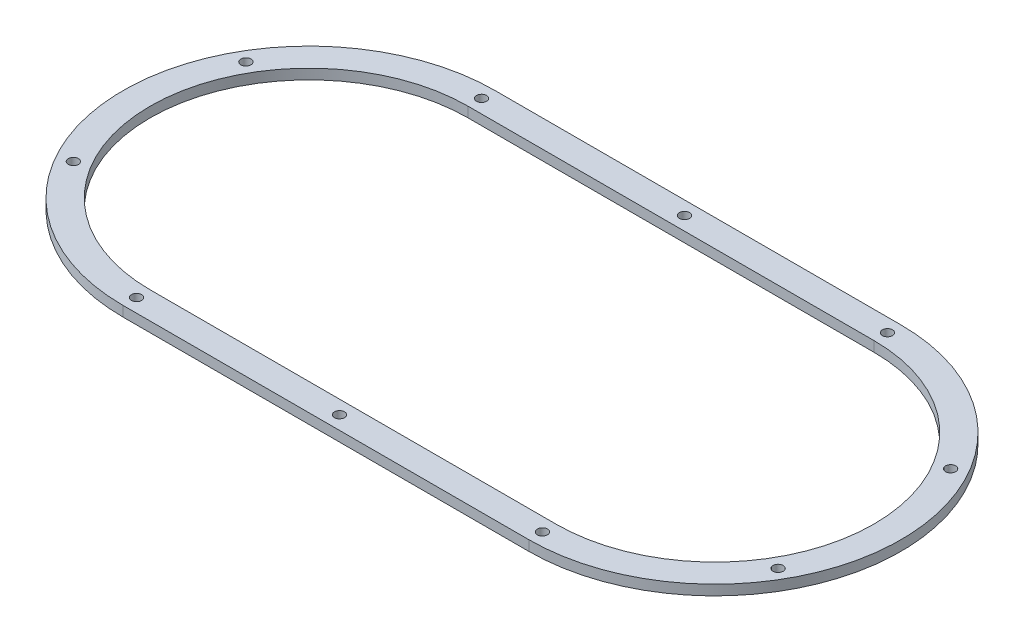
ISO-10303-21;
HEADER;
FILE_DESCRIPTION(('STEP AP214'),'2;1');
FILE_NAME('part.step','',(''),(''),'','','');
FILE_SCHEMA(('AUTOMOTIVE_DESIGN { 1 0 10303 214 1 1 1 1 }'));
ENDSEC;
DATA;
#1=APPLICATION_CONTEXT('core data for automotive mechanical design processes');
#2=APPLICATION_PROTOCOL_DEFINITION('international standard','automotive_design',2000,#1);
#3=PRODUCT_CONTEXT('',#1,'mechanical');
#4=PRODUCT('Part','Part','',(#3));
#5=PRODUCT_RELATED_PRODUCT_CATEGORY('part','',(#4));
#6=PRODUCT_DEFINITION_FORMATION('','',#4);
#7=PRODUCT_DEFINITION_CONTEXT('part definition',#1,'design');
#8=PRODUCT_DEFINITION('design','',#6,#7);
#9=PRODUCT_DEFINITION_SHAPE('','',#8);
#10=(LENGTH_UNIT() NAMED_UNIT(*) SI_UNIT(.MILLI.,.METRE.));
#11=(NAMED_UNIT(*) PLANE_ANGLE_UNIT() SI_UNIT($,.RADIAN.));
#12=(NAMED_UNIT(*) SI_UNIT($,.STERADIAN.) SOLID_ANGLE_UNIT());
#13=UNCERTAINTY_MEASURE_WITH_UNIT(LENGTH_MEASURE(1.E-05),#10,'distance_accuracy_value','');
#14=(GEOMETRIC_REPRESENTATION_CONTEXT(3) GLOBAL_UNCERTAINTY_ASSIGNED_CONTEXT((#13)) GLOBAL_UNIT_ASSIGNED_CONTEXT((#10,
#11,#12)) REPRESENTATION_CONTEXT('',''));
#15=CARTESIAN_POINT('',(0.,0.,0.));
#16=DIRECTION('',(0.,0.,1.));
#17=DIRECTION('',(1.,0.,0.));
#18=AXIS2_PLACEMENT_3D('',#15,#16,#17);
#19=CARTESIAN_POINT('',(0.,0.,0.));
#20=DIRECTION('',(0.,1.,0.));
#21=DIRECTION('',(0.,0.,1.));
#22=AXIS2_PLACEMENT_3D('',#19,#20,#21);
#23=PLANE('',#22);
#24=DIRECTION('',(1.,0.,0.));
#25=VECTOR('',#24,1.);
#26=CARTESIAN_POINT('',(0.,0.,47.));
#27=LINE('',#26,#25);
#28=CARTESIAN_POINT('',(-60.,0.,47.));
#29=VERTEX_POINT('',#28);
#30=CARTESIAN_POINT('',(60.,0.,47.));
#31=VERTEX_POINT('',#30);
#32=EDGE_CURVE('E145',#29,#31,#27,.T.);
#33=ORIENTED_EDGE('',*,*,#32,.T.);
#34=CARTESIAN_POINT('',(60.,0.,0.));
#35=DIRECTION('',(0.,1.,0.));
#36=DIRECTION('',(0.,0.,1.));
#37=AXIS2_PLACEMENT_3D('',#34,#35,#36);
#38=CIRCLE('',#37,47.);
#39=CARTESIAN_POINT('',(60.,0.,-47.));
#40=VERTEX_POINT('',#39);
#41=EDGE_CURVE('E149',#31,#40,#38,.T.);
#42=ORIENTED_EDGE('',*,*,#41,.T.);
#43=DIRECTION('',(-1.,0.,0.));
#44=VECTOR('',#43,1.);
#45=CARTESIAN_POINT('',(0.,0.,-47.));
#46=LINE('',#45,#44);
#47=CARTESIAN_POINT('',(-60.,0.,-47.));
#48=VERTEX_POINT('',#47);
#49=EDGE_CURVE('E136',#40,#48,#46,.T.);
#50=ORIENTED_EDGE('',*,*,#49,.T.);
#51=CARTESIAN_POINT('',(-60.,0.,0.));
#52=DIRECTION('',(0.,1.,0.));
#53=DIRECTION('',(0.,0.,1.));
#54=AXIS2_PLACEMENT_3D('',#51,#52,#53);
#55=CIRCLE('',#54,47.);
#56=EDGE_CURVE('E111',#48,#29,#55,.T.);
#57=ORIENTED_EDGE('',*,*,#56,.T.);
#58=EDGE_LOOP('',(#33,#42,#50,#57));
#59=FACE_BOUND('',#58,.T.);
#60=CARTESIAN_POINT('',(-60.,0.,51.));
#61=DIRECTION('',(0.,1.,0.));
#62=DIRECTION('',(0.,0.,1.));
#63=AXIS2_PLACEMENT_3D('',#60,#61,#62);
#64=CIRCLE('',#63,1.49999999999481);
#65=CARTESIAN_POINT('',(-60.,0.,52.4999999999948));
#66=VERTEX_POINT('',#65);
#67=EDGE_CURVE('E213',#66,#66,#64,.T.);
#68=ORIENTED_EDGE('',*,*,#67,.T.);
#69=EDGE_LOOP('',(#68));
#70=FACE_BOUND('',#69,.T.);
#71=CARTESIAN_POINT('',(-104.167295593006,0.,25.5));
#72=DIRECTION('',(0.,1.,0.));
#73=DIRECTION('',(0.,0.,1.));
#74=AXIS2_PLACEMENT_3D('',#71,#72,#73);
#75=CIRCLE('',#74,1.49999999999561);
#76=CARTESIAN_POINT('',(-104.167295593006,0.,26.9999999999956));
#77=VERTEX_POINT('',#76);
#78=EDGE_CURVE('E209',#77,#77,#75,.T.);
#79=ORIENTED_EDGE('',*,*,#78,.T.);
#80=EDGE_LOOP('',(#79));
#81=FACE_BOUND('',#80,.T.);
#82=CARTESIAN_POINT('',(-104.167295593006,0.,-25.4999999999999));
#83=DIRECTION('',(0.,1.,0.));
#84=DIRECTION('',(0.,0.,1.));
#85=AXIS2_PLACEMENT_3D('',#82,#83,#84);
#86=CIRCLE('',#85,1.4999999999985);
#87=CARTESIAN_POINT('',(-104.167295593006,0.,-24.0000000000014));
#88=VERTEX_POINT('',#87);
#89=EDGE_CURVE('E205',#88,#88,#86,.T.);
#90=ORIENTED_EDGE('',*,*,#89,.T.);
#91=EDGE_LOOP('',(#90));
#92=FACE_BOUND('',#91,.T.);
#93=CARTESIAN_POINT('',(-60.,0.,-51.));
#94=DIRECTION('',(0.,1.,0.));
#95=DIRECTION('',(0.,0.,1.));
#96=AXIS2_PLACEMENT_3D('',#93,#94,#95);
#97=CIRCLE('',#96,1.5);
#98=CARTESIAN_POINT('',(-60.,0.,-49.5));
#99=VERTEX_POINT('',#98);
#100=EDGE_CURVE('E201',#99,#99,#97,.T.);
#101=ORIENTED_EDGE('',*,*,#100,.T.);
#102=EDGE_LOOP('',(#101));
#103=FACE_BOUND('',#102,.T.);
#104=CARTESIAN_POINT('',(0.,0.,-51.));
#105=DIRECTION('',(0.,1.,0.));
#106=DIRECTION('',(0.,0.,1.));
#107=AXIS2_PLACEMENT_3D('',#104,#105,#106);
#108=CIRCLE('',#107,1.5);
#109=CARTESIAN_POINT('',(0.,0.,-49.5));
#110=VERTEX_POINT('',#109);
#111=EDGE_CURVE('E197',#110,#110,#108,.T.);
#112=ORIENTED_EDGE('',*,*,#111,.T.);
#113=EDGE_LOOP('',(#112));
#114=FACE_BOUND('',#113,.T.);
#115=CARTESIAN_POINT('',(60.,0.,-51.));
#116=DIRECTION('',(0.,1.,0.));
#117=DIRECTION('',(0.,0.,1.));
#118=AXIS2_PLACEMENT_3D('',#115,#116,#117);
#119=CIRCLE('',#118,1.5);
#120=CARTESIAN_POINT('',(60.,0.,-49.5));
#121=VERTEX_POINT('',#120);
#122=EDGE_CURVE('E193',#121,#121,#119,.T.);
#123=ORIENTED_EDGE('',*,*,#122,.T.);
#124=EDGE_LOOP('',(#123));
#125=FACE_BOUND('',#124,.T.);
#126=CARTESIAN_POINT('',(-60.,0.,0.));
#127=DIRECTION('',(0.,1.,0.));
#128=DIRECTION('',(0.,0.,1.));
#129=AXIS2_PLACEMENT_3D('',#126,#127,#128);
#130=CIRCLE('',#129,55.);
#131=CARTESIAN_POINT('',(-60.,0.,-55.));
#132=VERTEX_POINT('',#131);
#133=CARTESIAN_POINT('',(-60.,0.,55.));
#134=VERTEX_POINT('',#133);
#135=EDGE_CURVE('E11',#132,#134,#130,.T.);
#136=ORIENTED_EDGE('',*,*,#135,.F.);
#137=DIRECTION('',(-1.,0.,0.));
#138=VECTOR('',#137,1.);
#139=CARTESIAN_POINT('',(0.,0.,-55.));
#140=LINE('',#139,#138);
#141=CARTESIAN_POINT('',(60.,0.,-55.));
#142=VERTEX_POINT('',#141);
#143=EDGE_CURVE('E48',#142,#132,#140,.T.);
#144=ORIENTED_EDGE('',*,*,#143,.F.);
#145=CARTESIAN_POINT('',(60.,0.,0.));
#146=DIRECTION('',(0.,1.,0.));
#147=DIRECTION('',(0.,0.,1.));
#148=AXIS2_PLACEMENT_3D('',#145,#146,#147);
#149=CIRCLE('',#148,55.);
#150=CARTESIAN_POINT('',(60.,0.,55.));
#151=VERTEX_POINT('',#150);
#152=EDGE_CURVE('E265',#151,#142,#149,.T.);
#153=ORIENTED_EDGE('',*,*,#152,.F.);
#154=DIRECTION('',(1.,0.,0.));
#155=VECTOR('',#154,1.);
#156=CARTESIAN_POINT('',(0.,0.,55.));
#157=LINE('',#156,#155);
#158=EDGE_CURVE('E253',#134,#151,#157,.T.);
#159=ORIENTED_EDGE('',*,*,#158,.F.);
#160=EDGE_LOOP('',(#136,#144,#153,#159));
#161=FACE_BOUND('',#160,.T.);
#162=CARTESIAN_POINT('',(0.,0.,51.));
#163=DIRECTION('',(0.,1.,0.));
#164=DIRECTION('',(0.,0.,1.));
#165=AXIS2_PLACEMENT_3D('',#162,#163,#164);
#166=CIRCLE('',#165,1.5);
#167=CARTESIAN_POINT('',(0.,0.,52.5));
#168=VERTEX_POINT('',#167);
#169=EDGE_CURVE('E217',#168,#168,#166,.F.);
#170=ORIENTED_EDGE('',*,*,#169,.F.);
#171=EDGE_LOOP('',(#170));
#172=FACE_BOUND('',#171,.T.);
#173=CARTESIAN_POINT('',(60.,0.,51.));
#174=DIRECTION('',(0.,1.,0.));
#175=DIRECTION('',(0.,0.,1.));
#176=AXIS2_PLACEMENT_3D('',#173,#174,#175);
#177=CIRCLE('',#176,1.5);
#178=CARTESIAN_POINT('',(60.,0.,52.5));
#179=VERTEX_POINT('',#178);
#180=EDGE_CURVE('E221',#179,#179,#177,.F.);
#181=ORIENTED_EDGE('',*,*,#180,.F.);
#182=EDGE_LOOP('',(#181));
#183=FACE_BOUND('',#182,.T.);
#184=CARTESIAN_POINT('',(104.167295593006,0.,25.5));
#185=DIRECTION('',(0.,1.,0.));
#186=DIRECTION('',(0.,0.,1.));
#187=AXIS2_PLACEMENT_3D('',#184,#185,#186);
#188=CIRCLE('',#187,1.49999999999561);
#189=CARTESIAN_POINT('',(104.167295593006,0.,26.9999999999956));
#190=VERTEX_POINT('',#189);
#191=EDGE_CURVE('E225',#190,#190,#188,.F.);
#192=ORIENTED_EDGE('',*,*,#191,.F.);
#193=EDGE_LOOP('',(#192));
#194=FACE_BOUND('',#193,.T.);
#195=CARTESIAN_POINT('',(104.167295593006,0.,-25.4999999999999));
#196=DIRECTION('',(0.,1.,0.));
#197=DIRECTION('',(0.,0.,1.));
#198=AXIS2_PLACEMENT_3D('',#195,#196,#197);
#199=CIRCLE('',#198,1.4999999999985);
#200=CARTESIAN_POINT('',(104.167295593006,0.,-24.0000000000014));
#201=VERTEX_POINT('',#200);
#202=EDGE_CURVE('E229',#201,#201,#199,.F.);
#203=ORIENTED_EDGE('',*,*,#202,.F.);
#204=EDGE_LOOP('',(#203));
#205=FACE_BOUND('',#204,.T.);
#206=ADVANCED_FACE('F40',(#59,#70,#81,#92,#103,#114,#125,#161,#172,#183,#194,#205),#23,.F.);
#207=CARTESIAN_POINT('',(0.,3.,0.));
#208=DIRECTION('',(0.,1.,0.));
#209=DIRECTION('',(0.,0.,1.));
#210=AXIS2_PLACEMENT_3D('',#207,#208,#209);
#211=PLANE('',#210);
#212=CARTESIAN_POINT('',(60.,3.,0.));
#213=DIRECTION('',(0.,1.,0.));
#214=DIRECTION('',(0.,0.,1.));
#215=AXIS2_PLACEMENT_3D('',#212,#213,#214);
#216=CIRCLE('',#215,47.);
#217=CARTESIAN_POINT('',(60.,3.,47.));
#218=VERTEX_POINT('',#217);
#219=CARTESIAN_POINT('',(60.,3.,-47.));
#220=VERTEX_POINT('',#219);
#221=EDGE_CURVE('E63',#218,#220,#216,.T.);
#222=ORIENTED_EDGE('',*,*,#221,.F.);
#223=DIRECTION('',(1.,0.,0.));
#224=VECTOR('',#223,1.);
#225=CARTESIAN_POINT('',(-60.,3.,47.));
#226=LINE('',#225,#224);
#227=CARTESIAN_POINT('',(-60.,3.,47.));
#228=VERTEX_POINT('',#227);
#229=EDGE_CURVE('E126',#228,#218,#226,.T.);
#230=ORIENTED_EDGE('',*,*,#229,.F.);
#231=CARTESIAN_POINT('',(-60.,3.,0.));
#232=DIRECTION('',(0.,1.,0.));
#233=DIRECTION('',(0.,0.,1.));
#234=AXIS2_PLACEMENT_3D('',#231,#232,#233);
#235=CIRCLE('',#234,47.);
#236=CARTESIAN_POINT('',(-60.,3.,-47.));
#237=VERTEX_POINT('',#236);
#238=EDGE_CURVE('E108',#237,#228,#235,.T.);
#239=ORIENTED_EDGE('',*,*,#238,.F.);
#240=DIRECTION('',(-1.,0.,0.));
#241=VECTOR('',#240,1.);
#242=CARTESIAN_POINT('',(60.,3.,-47.));
#243=LINE('',#242,#241);
#244=EDGE_CURVE('E118',#220,#237,#243,.T.);
#245=ORIENTED_EDGE('',*,*,#244,.F.);
#246=EDGE_LOOP('',(#222,#230,#239,#245));
#247=FACE_BOUND('',#246,.T.);
#248=CARTESIAN_POINT('',(104.167295593006,3.,25.5));
#249=DIRECTION('',(0.,1.,0.));
#250=DIRECTION('',(0.,0.,1.));
#251=AXIS2_PLACEMENT_3D('',#248,#249,#250);
#252=CIRCLE('',#251,1.49999999999561);
#253=CARTESIAN_POINT('',(104.167295593006,3.,26.9999999999956));
#254=VERTEX_POINT('',#253);
#255=EDGE_CURVE('E163',#254,#254,#252,.F.);
#256=ORIENTED_EDGE('',*,*,#255,.T.);
#257=EDGE_LOOP('',(#256));
#258=FACE_BOUND('',#257,.T.);
#259=CARTESIAN_POINT('',(0.,3.,51.));
#260=DIRECTION('',(0.,1.,0.));
#261=DIRECTION('',(0.,0.,1.));
#262=AXIS2_PLACEMENT_3D('',#259,#260,#261);
#263=CIRCLE('',#262,1.5);
#264=CARTESIAN_POINT('',(0.,3.,52.5));
#265=VERTEX_POINT('',#264);
#266=EDGE_CURVE('E171',#265,#265,#263,.F.);
#267=ORIENTED_EDGE('',*,*,#266,.T.);
#268=EDGE_LOOP('',(#267));
#269=FACE_BOUND('',#268,.T.);
#270=CARTESIAN_POINT('',(-60.,3.,51.));
#271=DIRECTION('',(0.,1.,0.));
#272=DIRECTION('',(0.,0.,1.));
#273=AXIS2_PLACEMENT_3D('',#270,#271,#272);
#274=CIRCLE('',#273,1.49999999999481);
#275=CARTESIAN_POINT('',(-60.,3.,52.4999999999948));
#276=VERTEX_POINT('',#275);
#277=EDGE_CURVE('E175',#276,#276,#274,.T.);
#278=ORIENTED_EDGE('',*,*,#277,.F.);
#279=EDGE_LOOP('',(#278));
#280=FACE_BOUND('',#279,.T.);
#281=CARTESIAN_POINT('',(-104.167295593006,3.,25.5));
#282=DIRECTION('',(0.,1.,0.));
#283=DIRECTION('',(0.,0.,1.));
#284=AXIS2_PLACEMENT_3D('',#281,#282,#283);
#285=CIRCLE('',#284,1.49999999999561);
#286=CARTESIAN_POINT('',(-104.167295593006,3.,26.9999999999956));
#287=VERTEX_POINT('',#286);
#288=EDGE_CURVE('E179',#287,#287,#285,.T.);
#289=ORIENTED_EDGE('',*,*,#288,.F.);
#290=EDGE_LOOP('',(#289));
#291=FACE_BOUND('',#290,.T.);
#292=CARTESIAN_POINT('',(-104.167295593006,3.,-25.4999999999999));
#293=DIRECTION('',(0.,1.,0.));
#294=DIRECTION('',(0.,0.,1.));
#295=AXIS2_PLACEMENT_3D('',#292,#293,#294);
#296=CIRCLE('',#295,1.4999999999985);
#297=CARTESIAN_POINT('',(-104.167295593006,3.,-24.0000000000014));
#298=VERTEX_POINT('',#297);
#299=EDGE_CURVE('E183',#298,#298,#296,.T.);
#300=ORIENTED_EDGE('',*,*,#299,.F.);
#301=EDGE_LOOP('',(#300));
#302=FACE_BOUND('',#301,.T.);
#303=CARTESIAN_POINT('',(-60.,3.,-51.));
#304=DIRECTION('',(0.,1.,0.));
#305=DIRECTION('',(0.,0.,1.));
#306=AXIS2_PLACEMENT_3D('',#303,#304,#305);
#307=CIRCLE('',#306,1.5);
#308=CARTESIAN_POINT('',(-60.,3.,-49.5));
#309=VERTEX_POINT('',#308);
#310=EDGE_CURVE('E157',#309,#309,#307,.T.);
#311=ORIENTED_EDGE('',*,*,#310,.F.);
#312=EDGE_LOOP('',(#311));
#313=FACE_BOUND('',#312,.T.);
#314=CARTESIAN_POINT('',(0.,3.,-51.));
#315=DIRECTION('',(0.,1.,0.));
#316=DIRECTION('',(0.,0.,1.));
#317=AXIS2_PLACEMENT_3D('',#314,#315,#316);
#318=CIRCLE('',#317,1.5);
#319=CARTESIAN_POINT('',(0.,3.,-49.5));
#320=VERTEX_POINT('',#319);
#321=EDGE_CURVE('E153',#320,#320,#318,.T.);
#322=ORIENTED_EDGE('',*,*,#321,.F.);
#323=EDGE_LOOP('',(#322));
#324=FACE_BOUND('',#323,.T.);
#325=CARTESIAN_POINT('',(60.,3.,-51.));
#326=DIRECTION('',(0.,1.,0.));
#327=DIRECTION('',(0.,0.,1.));
#328=AXIS2_PLACEMENT_3D('',#325,#326,#327);
#329=CIRCLE('',#328,1.5);
#330=CARTESIAN_POINT('',(60.,3.,-49.5));
#331=VERTEX_POINT('',#330);
#332=EDGE_CURVE('E162',#331,#331,#329,.T.);
#333=ORIENTED_EDGE('',*,*,#332,.F.);
#334=EDGE_LOOP('',(#333));
#335=FACE_BOUND('',#334,.T.);
#336=DIRECTION('',(-1.,0.,0.));
#337=VECTOR('',#336,1.);
#338=CARTESIAN_POINT('',(60.,3.,-55.));
#339=LINE('',#338,#337);
#340=CARTESIAN_POINT('',(60.,3.,-55.));
#341=VERTEX_POINT('',#340);
#342=CARTESIAN_POINT('',(-60.,3.,-55.));
#343=VERTEX_POINT('',#342);
#344=EDGE_CURVE('E245',#341,#343,#339,.T.);
#345=ORIENTED_EDGE('',*,*,#344,.T.);
#346=CARTESIAN_POINT('',(-60.,3.,0.));
#347=DIRECTION('',(0.,1.,0.));
#348=DIRECTION('',(0.,0.,1.));
#349=AXIS2_PLACEMENT_3D('',#346,#347,#348);
#350=CIRCLE('',#349,55.);
#351=CARTESIAN_POINT('',(-60.,3.,55.));
#352=VERTEX_POINT('',#351);
#353=EDGE_CURVE('E233',#343,#352,#350,.T.);
#354=ORIENTED_EDGE('',*,*,#353,.T.);
#355=DIRECTION('',(1.,0.,0.));
#356=VECTOR('',#355,1.);
#357=CARTESIAN_POINT('',(-60.,3.,55.));
#358=LINE('',#357,#356);
#359=CARTESIAN_POINT('',(60.,3.,55.));
#360=VERTEX_POINT('',#359);
#361=EDGE_CURVE('E237',#352,#360,#358,.T.);
#362=ORIENTED_EDGE('',*,*,#361,.T.);
#363=CARTESIAN_POINT('',(60.,3.,0.));
#364=DIRECTION('',(0.,1.,0.));
#365=DIRECTION('',(0.,0.,1.));
#366=AXIS2_PLACEMENT_3D('',#363,#364,#365);
#367=CIRCLE('',#366,55.);
#368=EDGE_CURVE('E241',#360,#341,#367,.T.);
#369=ORIENTED_EDGE('',*,*,#368,.T.);
#370=EDGE_LOOP('',(#345,#354,#362,#369));
#371=FACE_BOUND('',#370,.T.);
#372=CARTESIAN_POINT('',(60.,3.,51.));
#373=DIRECTION('',(0.,1.,0.));
#374=DIRECTION('',(0.,0.,1.));
#375=AXIS2_PLACEMENT_3D('',#372,#373,#374);
#376=CIRCLE('',#375,1.5);
#377=CARTESIAN_POINT('',(60.,3.,52.5));
#378=VERTEX_POINT('',#377);
#379=EDGE_CURVE('E167',#378,#378,#376,.F.);
#380=ORIENTED_EDGE('',*,*,#379,.T.);
#381=EDGE_LOOP('',(#380));
#382=FACE_BOUND('',#381,.T.);
#383=CARTESIAN_POINT('',(104.167295593006,3.,-25.4999999999999));
#384=DIRECTION('',(0.,1.,0.));
#385=DIRECTION('',(0.,0.,1.));
#386=AXIS2_PLACEMENT_3D('',#383,#384,#385);
#387=CIRCLE('',#386,1.4999999999985);
#388=CARTESIAN_POINT('',(104.167295593006,3.,-24.0000000000014));
#389=VERTEX_POINT('',#388);
#390=EDGE_CURVE('E158',#389,#389,#387,.F.);
#391=ORIENTED_EDGE('',*,*,#390,.T.);
#392=EDGE_LOOP('',(#391));
#393=FACE_BOUND('',#392,.T.);
#394=ADVANCED_FACE('F123',(#247,#258,#269,#280,#291,#302,#313,#324,#335,#371,#382,#393),#211,.T.);
#395=CARTESIAN_POINT('',(-60.,-7.,0.));
#396=DIRECTION('',(0.,1.,0.));
#397=DIRECTION('',(0.,0.,1.));
#398=AXIS2_PLACEMENT_3D('',#395,#396,#397);
#399=CYLINDRICAL_SURFACE('',#398,55.);
#400=ORIENTED_EDGE('',*,*,#135,.T.);
#401=DIRECTION('',(0.,1.,0.));
#402=VECTOR('',#401,1.);
#403=CARTESIAN_POINT('',(-60.,-7.,55.));
#404=LINE('',#403,#402);
#405=EDGE_CURVE('E249',#134,#352,#404,.T.);
#406=ORIENTED_EDGE('',*,*,#405,.T.);
#407=ORIENTED_EDGE('',*,*,#353,.F.);
#408=DIRECTION('',(0.,1.,0.));
#409=VECTOR('',#408,1.);
#410=CARTESIAN_POINT('',(-60.,-7.,-55.));
#411=LINE('',#410,#409);
#412=EDGE_CURVE('E250',#132,#343,#411,.T.);
#413=ORIENTED_EDGE('',*,*,#412,.F.);
#414=EDGE_LOOP('',(#400,#406,#407,#413));
#415=FACE_BOUND('',#414,.T.);
#416=ADVANCED_FACE('F279',(#415),#399,.T.);
#417=CARTESIAN_POINT('',(60.,-7.,-55.));
#418=DIRECTION('',(0.,0.,-1.));
#419=DIRECTION('',(-1.,0.,0.));
#420=AXIS2_PLACEMENT_3D('',#417,#418,#419);
#421=PLANE('',#420);
#422=ORIENTED_EDGE('',*,*,#143,.T.);
#423=ORIENTED_EDGE('',*,*,#412,.T.);
#424=ORIENTED_EDGE('',*,*,#344,.F.);
#425=DIRECTION('',(0.,1.,0.));
#426=VECTOR('',#425,1.);
#427=CARTESIAN_POINT('',(60.,-7.,-55.));
#428=LINE('',#427,#426);
#429=EDGE_CURVE('E254',#142,#341,#428,.T.);
#430=ORIENTED_EDGE('',*,*,#429,.F.);
#431=EDGE_LOOP('',(#422,#423,#424,#430));
#432=FACE_BOUND('',#431,.T.);
#433=ADVANCED_FACE('F272',(#432),#421,.T.);
#434=CARTESIAN_POINT('',(60.,-7.,0.));
#435=DIRECTION('',(0.,1.,0.));
#436=DIRECTION('',(0.,0.,1.));
#437=AXIS2_PLACEMENT_3D('',#434,#435,#436);
#438=CYLINDRICAL_SURFACE('',#437,55.);
#439=ORIENTED_EDGE('',*,*,#152,.T.);
#440=ORIENTED_EDGE('',*,*,#429,.T.);
#441=ORIENTED_EDGE('',*,*,#368,.F.);
#442=DIRECTION('',(0.,1.,0.));
#443=VECTOR('',#442,1.);
#444=CARTESIAN_POINT('',(60.,-7.,55.));
#445=LINE('',#444,#443);
#446=EDGE_CURVE('E257',#151,#360,#445,.T.);
#447=ORIENTED_EDGE('',*,*,#446,.F.);
#448=EDGE_LOOP('',(#439,#440,#441,#447));
#449=FACE_BOUND('',#448,.T.);
#450=ADVANCED_FACE('F287',(#449),#438,.T.);
#451=CARTESIAN_POINT('',(-60.,-7.,55.));
#452=DIRECTION('',(0.,0.,1.));
#453=DIRECTION('',(1.,0.,0.));
#454=AXIS2_PLACEMENT_3D('',#451,#452,#453);
#455=PLANE('',#454);
#456=ORIENTED_EDGE('',*,*,#158,.T.);
#457=ORIENTED_EDGE('',*,*,#446,.T.);
#458=ORIENTED_EDGE('',*,*,#361,.F.);
#459=ORIENTED_EDGE('',*,*,#405,.F.);
#460=EDGE_LOOP('',(#456,#457,#458,#459));
#461=FACE_BOUND('',#460,.T.);
#462=ADVANCED_FACE('F284',(#461),#455,.T.);
#463=CARTESIAN_POINT('',(60.,-7.,-51.));
#464=DIRECTION('',(0.,1.,0.));
#465=DIRECTION('',(0.,0.,1.));
#466=AXIS2_PLACEMENT_3D('',#463,#464,#465);
#467=CYLINDRICAL_SURFACE('',#466,1.5);
#468=ORIENTED_EDGE('',*,*,#332,.T.);
#469=EDGE_LOOP('',(#468));
#470=FACE_BOUND('',#469,.T.);
#471=ORIENTED_EDGE('',*,*,#122,.F.);
#472=EDGE_LOOP('',(#471));
#473=FACE_BOUND('',#472,.T.);
#474=ADVANCED_FACE('F321',(#470,#473),#467,.F.);
#475=CARTESIAN_POINT('',(0.,-7.,-51.));
#476=DIRECTION('',(0.,1.,0.));
#477=DIRECTION('',(0.,0.,1.));
#478=AXIS2_PLACEMENT_3D('',#475,#476,#477);
#479=CYLINDRICAL_SURFACE('',#478,1.5);
#480=ORIENTED_EDGE('',*,*,#321,.T.);
#481=EDGE_LOOP('',(#480));
#482=FACE_BOUND('',#481,.T.);
#483=ORIENTED_EDGE('',*,*,#111,.F.);
#484=EDGE_LOOP('',(#483));
#485=FACE_BOUND('',#484,.T.);
#486=ADVANCED_FACE('F323',(#482,#485),#479,.F.);
#487=CARTESIAN_POINT('',(-60.,-7.,-51.));
#488=DIRECTION('',(0.,1.,0.));
#489=DIRECTION('',(0.,0.,1.));
#490=AXIS2_PLACEMENT_3D('',#487,#488,#489);
#491=CYLINDRICAL_SURFACE('',#490,1.5);
#492=ORIENTED_EDGE('',*,*,#310,.T.);
#493=EDGE_LOOP('',(#492));
#494=FACE_BOUND('',#493,.T.);
#495=ORIENTED_EDGE('',*,*,#100,.F.);
#496=EDGE_LOOP('',(#495));
#497=FACE_BOUND('',#496,.T.);
#498=ADVANCED_FACE('F330',(#494,#497),#491,.F.);
#499=CARTESIAN_POINT('',(-104.167295593006,-7.,-25.4999999999999));
#500=DIRECTION('',(0.,1.,0.));
#501=DIRECTION('',(0.,0.,1.));
#502=AXIS2_PLACEMENT_3D('',#499,#500,#501);
#503=CYLINDRICAL_SURFACE('',#502,1.4999999999985);
#504=ORIENTED_EDGE('',*,*,#299,.T.);
#505=EDGE_LOOP('',(#504));
#506=FACE_BOUND('',#505,.T.);
#507=ORIENTED_EDGE('',*,*,#89,.F.);
#508=EDGE_LOOP('',(#507));
#509=FACE_BOUND('',#508,.T.);
#510=ADVANCED_FACE('F379',(#506,#509),#503,.F.);
#511=CARTESIAN_POINT('',(-104.167295593006,-7.,25.5));
#512=DIRECTION('',(0.,1.,0.));
#513=DIRECTION('',(0.,0.,1.));
#514=AXIS2_PLACEMENT_3D('',#511,#512,#513);
#515=CYLINDRICAL_SURFACE('',#514,1.49999999999561);
#516=ORIENTED_EDGE('',*,*,#288,.T.);
#517=EDGE_LOOP('',(#516));
#518=FACE_BOUND('',#517,.T.);
#519=ORIENTED_EDGE('',*,*,#78,.F.);
#520=EDGE_LOOP('',(#519));
#521=FACE_BOUND('',#520,.T.);
#522=ADVANCED_FACE('F388',(#518,#521),#515,.F.);
#523=CARTESIAN_POINT('',(-60.,-7.,51.));
#524=DIRECTION('',(0.,1.,0.));
#525=DIRECTION('',(0.,0.,1.));
#526=AXIS2_PLACEMENT_3D('',#523,#524,#525);
#527=CYLINDRICAL_SURFACE('',#526,1.49999999999481);
#528=ORIENTED_EDGE('',*,*,#277,.T.);
#529=EDGE_LOOP('',(#528));
#530=FACE_BOUND('',#529,.T.);
#531=ORIENTED_EDGE('',*,*,#67,.F.);
#532=EDGE_LOOP('',(#531));
#533=FACE_BOUND('',#532,.T.);
#534=ADVANCED_FACE('F397',(#530,#533),#527,.F.);
#535=CARTESIAN_POINT('',(0.,-7.,51.));
#536=DIRECTION('',(0.,1.,0.));
#537=DIRECTION('',(0.,0.,1.));
#538=AXIS2_PLACEMENT_3D('',#535,#536,#537);
#539=CYLINDRICAL_SURFACE('',#538,1.5);
#540=ORIENTED_EDGE('',*,*,#266,.F.);
#541=EDGE_LOOP('',(#540));
#542=FACE_BOUND('',#541,.T.);
#543=ORIENTED_EDGE('',*,*,#169,.T.);
#544=EDGE_LOOP('',(#543));
#545=FACE_BOUND('',#544,.T.);
#546=ADVANCED_FACE('F408',(#542,#545),#539,.F.);
#547=CARTESIAN_POINT('',(60.,-7.,51.));
#548=DIRECTION('',(0.,1.,0.));
#549=DIRECTION('',(0.,0.,1.));
#550=AXIS2_PLACEMENT_3D('',#547,#548,#549);
#551=CYLINDRICAL_SURFACE('',#550,1.5);
#552=ORIENTED_EDGE('',*,*,#379,.F.);
#553=EDGE_LOOP('',(#552));
#554=FACE_BOUND('',#553,.T.);
#555=ORIENTED_EDGE('',*,*,#180,.T.);
#556=EDGE_LOOP('',(#555));
#557=FACE_BOUND('',#556,.T.);
#558=ADVANCED_FACE('F418',(#554,#557),#551,.F.);
#559=CARTESIAN_POINT('',(104.167295593006,-7.,25.5));
#560=DIRECTION('',(0.,1.,0.));
#561=DIRECTION('',(0.,0.,1.));
#562=AXIS2_PLACEMENT_3D('',#559,#560,#561);
#563=CYLINDRICAL_SURFACE('',#562,1.49999999999561);
#564=ORIENTED_EDGE('',*,*,#255,.F.);
#565=EDGE_LOOP('',(#564));
#566=FACE_BOUND('',#565,.T.);
#567=ORIENTED_EDGE('',*,*,#191,.T.);
#568=EDGE_LOOP('',(#567));
#569=FACE_BOUND('',#568,.T.);
#570=ADVANCED_FACE('F299',(#566,#569),#563,.F.);
#571=CARTESIAN_POINT('',(104.167295593006,-7.,-25.4999999999999));
#572=DIRECTION('',(0.,1.,0.));
#573=DIRECTION('',(0.,0.,1.));
#574=AXIS2_PLACEMENT_3D('',#571,#572,#573);
#575=CYLINDRICAL_SURFACE('',#574,1.4999999999985);
#576=ORIENTED_EDGE('',*,*,#390,.F.);
#577=EDGE_LOOP('',(#576));
#578=FACE_BOUND('',#577,.T.);
#579=ORIENTED_EDGE('',*,*,#202,.T.);
#580=EDGE_LOOP('',(#579));
#581=FACE_BOUND('',#580,.T.);
#582=ADVANCED_FACE('F295',(#578,#581),#575,.F.);
#583=CARTESIAN_POINT('',(60.,-7.,0.));
#584=DIRECTION('',(0.,1.,0.));
#585=DIRECTION('',(0.,0.,1.));
#586=AXIS2_PLACEMENT_3D('',#583,#584,#585);
#587=CYLINDRICAL_SURFACE('',#586,47.);
#588=DIRECTION('',(0.,1.,0.));
#589=VECTOR('',#588,1.);
#590=CARTESIAN_POINT('',(60.,-7.,47.));
#591=LINE('',#590,#589);
#592=EDGE_CURVE('E133',#31,#218,#591,.T.);
#593=ORIENTED_EDGE('',*,*,#592,.T.);
#594=ORIENTED_EDGE('',*,*,#221,.T.);
#595=DIRECTION('',(0.,1.,0.));
#596=VECTOR('',#595,1.);
#597=CARTESIAN_POINT('',(60.,-7.,-47.));
#598=LINE('',#597,#596);
#599=EDGE_CURVE('E115',#40,#220,#598,.T.);
#600=ORIENTED_EDGE('',*,*,#599,.F.);
#601=ORIENTED_EDGE('',*,*,#41,.F.);
#602=EDGE_LOOP('',(#593,#594,#600,#601));
#603=FACE_BOUND('',#602,.T.);
#604=ADVANCED_FACE('F298',(#603),#587,.F.);
#605=CARTESIAN_POINT('',(-60.,-7.,47.));
#606=DIRECTION('',(0.,0.,1.));
#607=DIRECTION('',(1.,0.,0.));
#608=AXIS2_PLACEMENT_3D('',#605,#606,#607);
#609=PLANE('',#608);
#610=DIRECTION('',(0.,1.,0.));
#611=VECTOR('',#610,1.);
#612=CARTESIAN_POINT('',(-60.,-7.,47.));
#613=LINE('',#612,#611);
#614=EDGE_CURVE('E114',#29,#228,#613,.T.);
#615=ORIENTED_EDGE('',*,*,#614,.T.);
#616=ORIENTED_EDGE('',*,*,#229,.T.);
#617=ORIENTED_EDGE('',*,*,#592,.F.);
#618=ORIENTED_EDGE('',*,*,#32,.F.);
#619=EDGE_LOOP('',(#615,#616,#617,#618));
#620=FACE_BOUND('',#619,.T.);
#621=ADVANCED_FACE('F451',(#620),#609,.F.);
#622=CARTESIAN_POINT('',(-60.,-7.,0.));
#623=DIRECTION('',(0.,1.,0.));
#624=DIRECTION('',(0.,0.,1.));
#625=AXIS2_PLACEMENT_3D('',#622,#623,#624);
#626=CYLINDRICAL_SURFACE('',#625,47.);
#627=DIRECTION('',(0.,1.,0.));
#628=VECTOR('',#627,1.);
#629=CARTESIAN_POINT('',(-60.,-7.,-47.));
#630=LINE('',#629,#628);
#631=EDGE_CURVE('E55',#48,#237,#630,.T.);
#632=ORIENTED_EDGE('',*,*,#631,.T.);
#633=ORIENTED_EDGE('',*,*,#238,.T.);
#634=ORIENTED_EDGE('',*,*,#614,.F.);
#635=ORIENTED_EDGE('',*,*,#56,.F.);
#636=EDGE_LOOP('',(#632,#633,#634,#635));
#637=FACE_BOUND('',#636,.T.);
#638=ADVANCED_FACE('F105',(#637),#626,.F.);
#639=CARTESIAN_POINT('',(60.,-7.,-47.));
#640=DIRECTION('',(0.,0.,-1.));
#641=DIRECTION('',(-1.,0.,0.));
#642=AXIS2_PLACEMENT_3D('',#639,#640,#641);
#643=PLANE('',#642);
#644=ORIENTED_EDGE('',*,*,#599,.T.);
#645=ORIENTED_EDGE('',*,*,#244,.T.);
#646=ORIENTED_EDGE('',*,*,#631,.F.);
#647=ORIENTED_EDGE('',*,*,#49,.F.);
#648=EDGE_LOOP('',(#644,#645,#646,#647));
#649=FACE_BOUND('',#648,.T.);
#650=ADVANCED_FACE('F119',(#649),#643,.F.);
#651=CLOSED_SHELL('',(#206,#394,#416,#433,#450,#462,#474,#486,#498,#510,#522,#534,#546,#558,
#570,#582,#604,#621,#638,#650));
#652=MANIFOLD_SOLID_BREP('B2',#651);
#653=ADVANCED_BREP_SHAPE_REPRESENTATION('',(#18,#652),#14);
#654=SHAPE_DEFINITION_REPRESENTATION(#9,#653);
ENDSEC;
END-ISO-10303-21;
